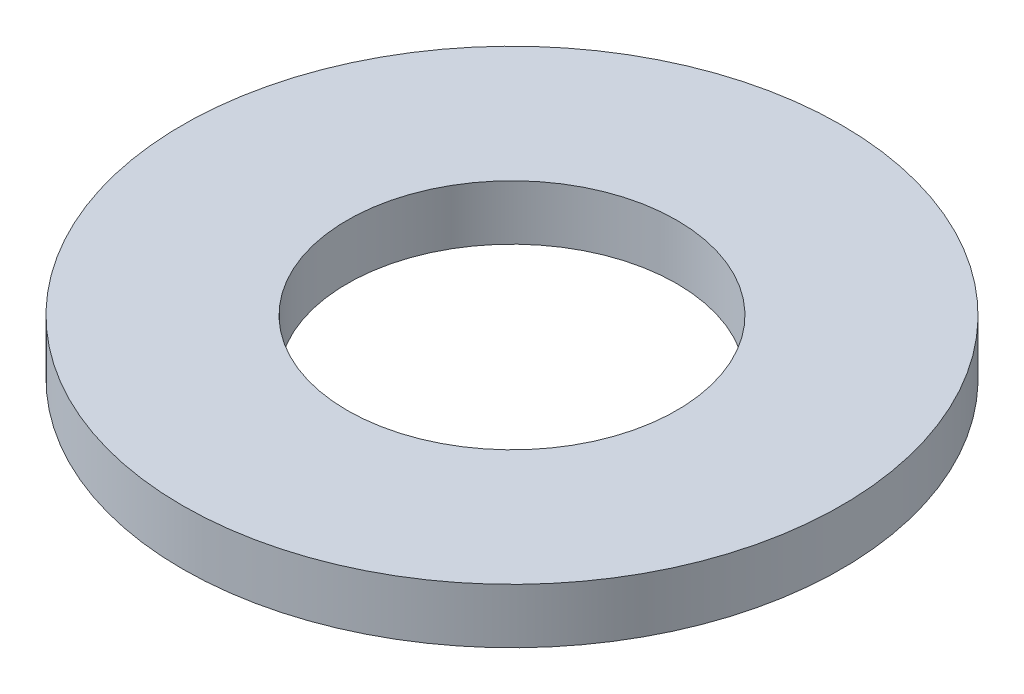
ISO-10303-21;
HEADER;
FILE_DESCRIPTION(('STEP AP214'),'2;1');
FILE_NAME('part.step','',(''),(''),'','','');
FILE_SCHEMA(('AUTOMOTIVE_DESIGN { 1 0 10303 214 1 1 1 1 }'));
ENDSEC;
DATA;
#1=APPLICATION_CONTEXT('core data for automotive mechanical design processes');
#2=APPLICATION_PROTOCOL_DEFINITION('international standard','automotive_design',2000,#1);
#3=PRODUCT_CONTEXT('',#1,'mechanical');
#4=PRODUCT('Part','Part','',(#3));
#5=PRODUCT_RELATED_PRODUCT_CATEGORY('part','',(#4));
#6=PRODUCT_DEFINITION_FORMATION('','',#4);
#7=PRODUCT_DEFINITION_CONTEXT('part definition',#1,'design');
#8=PRODUCT_DEFINITION('design','',#6,#7);
#9=PRODUCT_DEFINITION_SHAPE('','',#8);
#10=(LENGTH_UNIT() NAMED_UNIT(*) SI_UNIT(.MILLI.,.METRE.));
#11=(NAMED_UNIT(*) PLANE_ANGLE_UNIT() SI_UNIT($,.RADIAN.));
#12=(NAMED_UNIT(*) SI_UNIT($,.STERADIAN.) SOLID_ANGLE_UNIT());
#13=UNCERTAINTY_MEASURE_WITH_UNIT(LENGTH_MEASURE(1.E-05),#10,'distance_accuracy_value','');
#14=(GEOMETRIC_REPRESENTATION_CONTEXT(3) GLOBAL_UNCERTAINTY_ASSIGNED_CONTEXT((#13)) GLOBAL_UNIT_ASSIGNED_CONTEXT((#10,
#11,#12)) REPRESENTATION_CONTEXT('',''));
#15=CARTESIAN_POINT('',(0.,0.,0.));
#16=DIRECTION('',(0.,0.,1.));
#17=DIRECTION('',(1.,0.,0.));
#18=AXIS2_PLACEMENT_3D('',#15,#16,#17);
#19=CARTESIAN_POINT('',(0.,0.5,0.));
#20=DIRECTION('',(0.,1.,0.));
#21=DIRECTION('',(0.,0.,1.));
#22=AXIS2_PLACEMENT_3D('',#19,#20,#21);
#23=PLANE('',#22);
#24=CARTESIAN_POINT('',(0.,0.5,0.));
#25=DIRECTION('',(0.,1.,0.));
#26=DIRECTION('',(0.,0.,1.));
#27=AXIS2_PLACEMENT_3D('',#24,#25,#26);
#28=CIRCLE('',#27,3.);
#29=CARTESIAN_POINT('',(0.,0.5,3.));
#30=VERTEX_POINT('',#29);
#31=EDGE_CURVE('E10',#30,#30,#28,.T.);
#32=ORIENTED_EDGE('',*,*,#31,.T.);
#33=EDGE_LOOP('',(#32));
#34=FACE_BOUND('',#33,.T.);
#35=CARTESIAN_POINT('',(0.,0.5,0.));
#36=DIRECTION('',(0.,1.,0.));
#37=DIRECTION('',(0.,0.,1.));
#38=AXIS2_PLACEMENT_3D('',#35,#36,#37);
#39=CIRCLE('',#38,1.5);
#40=CARTESIAN_POINT('',(0.,0.5,1.5));
#41=VERTEX_POINT('',#40);
#42=EDGE_CURVE('E45',#41,#41,#39,.T.);
#43=ORIENTED_EDGE('',*,*,#42,.F.);
#44=EDGE_LOOP('',(#43));
#45=FACE_BOUND('',#44,.T.);
#46=ADVANCED_FACE('F34',(#34,#45),#23,.T.);
#47=CARTESIAN_POINT('',(0.,0.,0.));
#48=DIRECTION('',(0.,1.,0.));
#49=DIRECTION('',(0.,0.,1.));
#50=AXIS2_PLACEMENT_3D('',#47,#48,#49);
#51=PLANE('',#50);
#52=CARTESIAN_POINT('',(0.,0.,0.));
#53=DIRECTION('',(0.,1.,0.));
#54=DIRECTION('',(0.,0.,1.));
#55=AXIS2_PLACEMENT_3D('',#52,#53,#54);
#56=CIRCLE('',#55,3.);
#57=CARTESIAN_POINT('',(0.,0.,3.));
#58=VERTEX_POINT('',#57);
#59=EDGE_CURVE('E38',#58,#58,#56,.T.);
#60=ORIENTED_EDGE('',*,*,#59,.F.);
#61=EDGE_LOOP('',(#60));
#62=FACE_BOUND('',#61,.T.);
#63=CARTESIAN_POINT('',(0.,0.,0.));
#64=DIRECTION('',(0.,1.,0.));
#65=DIRECTION('',(0.,0.,1.));
#66=AXIS2_PLACEMENT_3D('',#63,#64,#65);
#67=CIRCLE('',#66,1.5);
#68=CARTESIAN_POINT('',(0.,0.,1.5));
#69=VERTEX_POINT('',#68);
#70=EDGE_CURVE('E47',#69,#69,#67,.T.);
#71=ORIENTED_EDGE('',*,*,#70,.T.);
#72=EDGE_LOOP('',(#71));
#73=FACE_BOUND('',#72,.T.);
#74=ADVANCED_FACE('F57',(#62,#73),#51,.F.);
#75=CARTESIAN_POINT('',(0.,0.5,0.));
#76=DIRECTION('',(0.,-1.,0.));
#77=DIRECTION('',(0.,0.,-1.));
#78=AXIS2_PLACEMENT_3D('',#75,#76,#77);
#79=CYLINDRICAL_SURFACE('',#78,3.);
#80=ORIENTED_EDGE('',*,*,#31,.F.);
#81=EDGE_LOOP('',(#80));
#82=FACE_BOUND('',#81,.T.);
#83=ORIENTED_EDGE('',*,*,#59,.T.);
#84=EDGE_LOOP('',(#83));
#85=FACE_BOUND('',#84,.T.);
#86=ADVANCED_FACE('F36',(#82,#85),#79,.T.);
#87=CARTESIAN_POINT('',(0.,0.5,0.));
#88=DIRECTION('',(0.,-1.,0.));
#89=DIRECTION('',(0.,0.,-1.));
#90=AXIS2_PLACEMENT_3D('',#87,#88,#89);
#91=CYLINDRICAL_SURFACE('',#90,1.5);
#92=ORIENTED_EDGE('',*,*,#42,.T.);
#93=EDGE_LOOP('',(#92));
#94=FACE_BOUND('',#93,.T.);
#95=ORIENTED_EDGE('',*,*,#70,.F.);
#96=EDGE_LOOP('',(#95));
#97=FACE_BOUND('',#96,.T.);
#98=ADVANCED_FACE('F53',(#94,#97),#91,.F.);
#99=CLOSED_SHELL('',(#46,#74,#86,#98));
#100=MANIFOLD_SOLID_BREP('B2',#99);
#101=ADVANCED_BREP_SHAPE_REPRESENTATION('',(#18,#100),#14);
#102=SHAPE_DEFINITION_REPRESENTATION(#9,#101);
ENDSEC;
END-ISO-10303-21;
